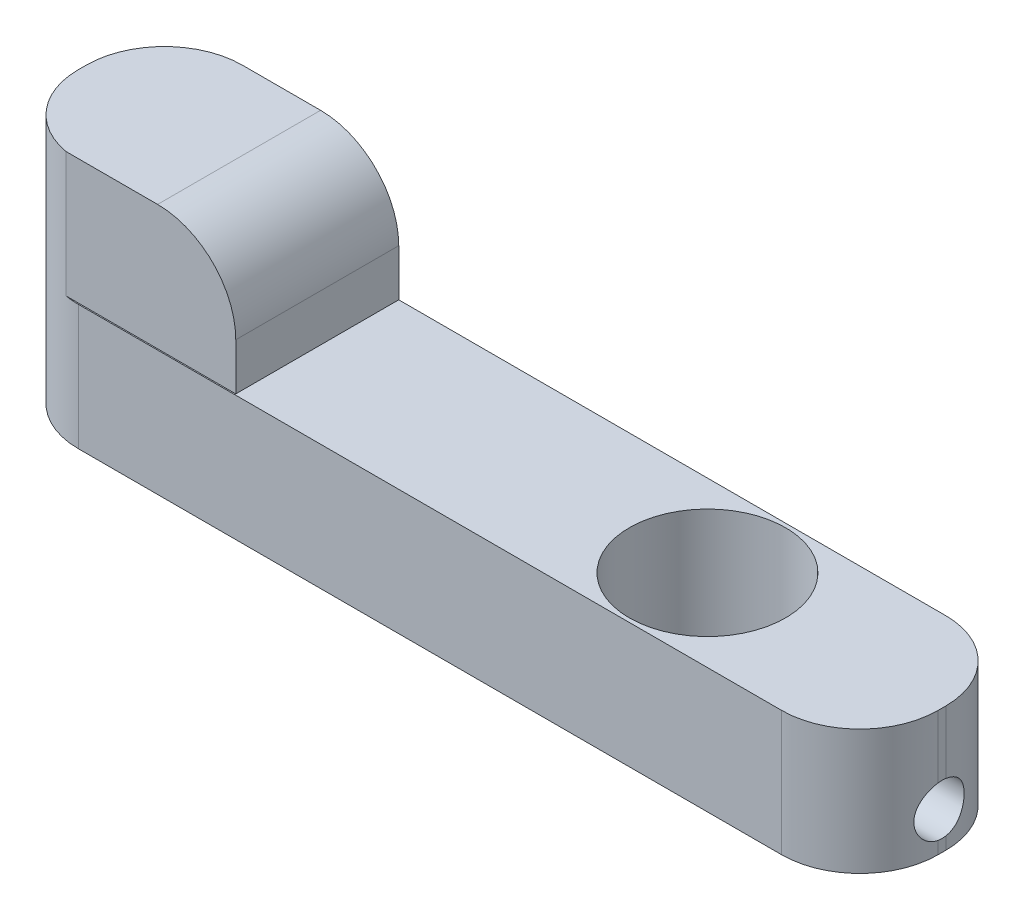
ISO-10303-21;
HEADER;
FILE_DESCRIPTION(('STEP AP214'),'2;1');
FILE_NAME('part.step','',(''),(''),'','','');
FILE_SCHEMA(('AUTOMOTIVE_DESIGN { 1 0 10303 214 1 1 1 1 }'));
ENDSEC;
DATA;
#1=APPLICATION_CONTEXT('core data for automotive mechanical design processes');
#2=APPLICATION_PROTOCOL_DEFINITION('international standard','automotive_design',2000,#1);
#3=PRODUCT_CONTEXT('',#1,'mechanical');
#4=PRODUCT('Part','Part','',(#3));
#5=PRODUCT_RELATED_PRODUCT_CATEGORY('part','',(#4));
#6=PRODUCT_DEFINITION_FORMATION('','',#4);
#7=PRODUCT_DEFINITION_CONTEXT('part definition',#1,'design');
#8=PRODUCT_DEFINITION('design','',#6,#7);
#9=PRODUCT_DEFINITION_SHAPE('','',#8);
#10=(LENGTH_UNIT() NAMED_UNIT(*) SI_UNIT(.MILLI.,.METRE.));
#11=(NAMED_UNIT(*) PLANE_ANGLE_UNIT() SI_UNIT($,.RADIAN.));
#12=(NAMED_UNIT(*) SI_UNIT($,.STERADIAN.) SOLID_ANGLE_UNIT());
#13=UNCERTAINTY_MEASURE_WITH_UNIT(LENGTH_MEASURE(1.E-05),#10,'distance_accuracy_value','');
#14=(GEOMETRIC_REPRESENTATION_CONTEXT(3) GLOBAL_UNCERTAINTY_ASSIGNED_CONTEXT((#13)) GLOBAL_UNIT_ASSIGNED_CONTEXT((#10,
#11,#12)) REPRESENTATION_CONTEXT('',''));
#15=CARTESIAN_POINT('',(0.,0.,0.));
#16=DIRECTION('',(0.,0.,1.));
#17=DIRECTION('',(1.,0.,0.));
#18=AXIS2_PLACEMENT_3D('',#15,#16,#17);
#19=CARTESIAN_POINT('',(275.,80.,-52.5000000000001));
#20=DIRECTION('',(-1.,0.,0.));
#21=DIRECTION('',(0.,0.,1.));
#22=AXIS2_PLACEMENT_3D('',#19,#20,#21);
#23=PLANE('',#22);
#24=DIRECTION('',(0.,1.,0.));
#25=VECTOR('',#24,1.);
#26=CARTESIAN_POINT('',(275.,80.,2.4999999999999));
#27=LINE('',#26,#25);
#28=CARTESIAN_POINT('',(275.,80.,2.4999999999999));
#29=VERTEX_POINT('',#28);
#30=CARTESIAN_POINT('',(275.,39.8047162816568,2.4999999999999));
#31=VERTEX_POINT('',#30);
#32=EDGE_CURVE('E155',#29,#31,#27,.F.);
#33=ORIENTED_EDGE('',*,*,#32,.T.);
#34=CARTESIAN_POINT('',(275.,23.9,-1.45386348462818E-13));
#35=DIRECTION('',(1.,0.,0.));
#36=DIRECTION('',(0.,0.,-1.));
#37=AXIS2_PLACEMENT_3D('',#34,#35,#36);
#38=CIRCLE('',#37,16.1);
#39=CARTESIAN_POINT('',(275.,39.8047162816569,-2.5000000000001));
#40=VERTEX_POINT('',#39);
#41=EDGE_CURVE('E141',#40,#31,#38,.T.);
#42=ORIENTED_EDGE('',*,*,#41,.F.);
#43=DIRECTION('',(0.,1.,0.));
#44=VECTOR('',#43,1.);
#45=CARTESIAN_POINT('',(275.,80.,-2.5000000000001));
#46=LINE('',#45,#44);
#47=CARTESIAN_POINT('',(275.,80.,-2.5000000000001));
#48=VERTEX_POINT('',#47);
#49=EDGE_CURVE('E152',#40,#48,#46,.T.);
#50=ORIENTED_EDGE('',*,*,#49,.T.);
#51=DIRECTION('',(0.,0.,-1.));
#52=VECTOR('',#51,1.);
#53=CARTESIAN_POINT('',(275.,80.,-52.5000000000001));
#54=LINE('',#53,#52);
#55=EDGE_CURVE('E250',#29,#48,#54,.T.);
#56=ORIENTED_EDGE('',*,*,#55,.F.);
#57=EDGE_LOOP('',(#33,#42,#50,#56));
#58=FACE_BOUND('',#57,.T.);
#59=ADVANCED_FACE('F33',(#58),#23,.F.);
#60=CARTESIAN_POINT('',(-175.,110.,0.));
#61=DIRECTION('',(0.,0.,1.));
#62=DIRECTION('',(1.,0.,0.));
#63=AXIS2_PLACEMENT_3D('',#60,#61,#62);
#64=CYLINDRICAL_SURFACE('',#63,50.);
#65=DIRECTION('',(0.,0.,-1.));
#66=VECTOR('',#65,1.);
#67=CARTESIAN_POINT('',(-175.,160.,0.));
#68=LINE('',#67,#66);
#69=CARTESIAN_POINT('',(-175.,160.,51.7681093220659));
#70=VERTEX_POINT('',#69);
#71=CARTESIAN_POINT('',(-175.,160.,-52.5000000000001));
#72=VERTEX_POINT('',#71);
#73=EDGE_CURVE('E205',#70,#72,#68,.T.);
#74=ORIENTED_EDGE('',*,*,#73,.F.);
#75=CARTESIAN_POINT('',(-175.,110.,51.7681093220659));
#76=DIRECTION('',(0.,0.,-1.));
#77=DIRECTION('',(-1.,0.,0.));
#78=AXIS2_PLACEMENT_3D('',#75,#76,#77);
#79=CIRCLE('',#78,50.);
#80=CARTESIAN_POINT('',(-125.,110.,51.7681093220659));
#81=VERTEX_POINT('',#80);
#82=EDGE_CURVE('E47',#81,#70,#79,.F.);
#83=ORIENTED_EDGE('',*,*,#82,.F.);
#84=DIRECTION('',(0.,0.,-1.));
#85=VECTOR('',#84,1.);
#86=CARTESIAN_POINT('',(-125.,110.,0.));
#87=LINE('',#86,#85);
#88=CARTESIAN_POINT('',(-125.,110.,-52.5000000000001));
#89=VERTEX_POINT('',#88);
#90=EDGE_CURVE('E208',#89,#81,#87,.F.);
#91=ORIENTED_EDGE('',*,*,#90,.F.);
#92=CARTESIAN_POINT('',(-175.,110.,-52.5));
#93=DIRECTION('',(0.,0.,1.));
#94=DIRECTION('',(1.,0.,0.));
#95=AXIS2_PLACEMENT_3D('',#92,#93,#94);
#96=CIRCLE('',#95,50.);
#97=EDGE_CURVE('E11',#72,#89,#96,.F.);
#98=ORIENTED_EDGE('',*,*,#97,.F.);
#99=EDGE_LOOP('',(#74,#83,#91,#98));
#100=FACE_BOUND('',#99,.T.);
#101=ADVANCED_FACE('F35',(#100),#64,.T.);
#102=CARTESIAN_POINT('',(-225.,80.,-2.50000000000002));
#103=DIRECTION('',(0.,1.,0.));
#104=DIRECTION('',(0.,0.,1.));
#105=AXIS2_PLACEMENT_3D('',#102,#103,#104);
#106=CYLINDRICAL_SURFACE('',#105,50.);
#107=DIRECTION('',(0.,1.,0.));
#108=VECTOR('',#107,1.);
#109=CARTESIAN_POINT('',(-225.,80.,-52.5));
#110=LINE('',#109,#108);
#111=CARTESIAN_POINT('',(-225.,0.,-52.5));
#112=VERTEX_POINT('',#111);
#113=CARTESIAN_POINT('',(-225.,160.,-52.5));
#114=VERTEX_POINT('',#113);
#115=EDGE_CURVE('E195',#112,#114,#110,.T.);
#116=ORIENTED_EDGE('',*,*,#115,.F.);
#117=CARTESIAN_POINT('',(-225.,0.,-2.50000000000002));
#118=DIRECTION('',(0.,1.,0.));
#119=DIRECTION('',(0.,0.,1.));
#120=AXIS2_PLACEMENT_3D('',#117,#118,#119);
#121=CIRCLE('',#120,50.);
#122=CARTESIAN_POINT('',(-275.,0.,-2.50000000000002));
#123=VERTEX_POINT('',#122);
#124=EDGE_CURVE('E201',#123,#112,#121,.F.);
#125=ORIENTED_EDGE('',*,*,#124,.F.);
#126=DIRECTION('',(0.,1.,0.));
#127=VECTOR('',#126,1.);
#128=CARTESIAN_POINT('',(-275.,80.,-2.50000000000002));
#129=LINE('',#128,#127);
#130=CARTESIAN_POINT('',(-275.,160.,-2.50000000000002));
#131=VERTEX_POINT('',#130);
#132=EDGE_CURVE('E198',#131,#123,#129,.F.);
#133=ORIENTED_EDGE('',*,*,#132,.F.);
#134=CARTESIAN_POINT('',(-225.,160.,-2.50000000000002));
#135=DIRECTION('',(0.,1.,0.));
#136=DIRECTION('',(0.,0.,1.));
#137=AXIS2_PLACEMENT_3D('',#134,#135,#136);
#138=CIRCLE('',#137,50.);
#139=EDGE_CURVE('E203',#114,#131,#138,.T.);
#140=ORIENTED_EDGE('',*,*,#139,.F.);
#141=EDGE_LOOP('',(#116,#125,#133,#140));
#142=FACE_BOUND('',#141,.T.);
#143=ADVANCED_FACE('F302',(#142),#106,.T.);
#144=CARTESIAN_POINT('',(-225.,80.,2.50000000000006));
#145=DIRECTION('',(0.,1.,0.));
#146=DIRECTION('',(0.,0.,1.));
#147=AXIS2_PLACEMENT_3D('',#144,#145,#146);
#148=CYLINDRICAL_SURFACE('',#147,50.);
#149=DIRECTION('',(0.,1.,0.));
#150=VECTOR('',#149,1.);
#151=CARTESIAN_POINT('',(-275.,80.,2.50000000000006));
#152=LINE('',#151,#150);
#153=CARTESIAN_POINT('',(-275.,0.,2.50000000000006));
#154=VERTEX_POINT('',#153);
#155=CARTESIAN_POINT('',(-275.,160.,2.50000000000006));
#156=VERTEX_POINT('',#155);
#157=EDGE_CURVE('E177',#154,#156,#152,.T.);
#158=ORIENTED_EDGE('',*,*,#157,.F.);
#159=CARTESIAN_POINT('',(-225.,0.,2.50000000000006));
#160=DIRECTION('',(0.,1.,0.));
#161=DIRECTION('',(0.,0.,1.));
#162=AXIS2_PLACEMENT_3D('',#159,#160,#161);
#163=CIRCLE('',#162,50.);
#164=CARTESIAN_POINT('',(-225.,0.,52.5000000000001));
#165=VERTEX_POINT('',#164);
#166=EDGE_CURVE('E192',#165,#154,#163,.F.);
#167=ORIENTED_EDGE('',*,*,#166,.F.);
#168=DIRECTION('',(0.,1.,0.));
#169=VECTOR('',#168,1.);
#170=CARTESIAN_POINT('',(-225.,80.,52.5000000000001));
#171=LINE('',#170,#169);
#172=CARTESIAN_POINT('',(-225.,80.,52.5000000000001));
#173=VERTEX_POINT('',#172);
#174=EDGE_CURVE('E189',#173,#165,#171,.F.);
#175=ORIENTED_EDGE('',*,*,#174,.F.);
#176=CARTESIAN_POINT('',(-225.,80.,2.50000000000006));
#177=DIRECTION('',(0.,1.,0.));
#178=DIRECTION('',(0.,0.,1.));
#179=AXIS2_PLACEMENT_3D('',#176,#177,#178);
#180=CIRCLE('',#179,50.);
#181=CARTESIAN_POINT('',(-233.523696605873,80.,51.7681093220659));
#182=VERTEX_POINT('',#181);
#183=EDGE_CURVE('E186',#182,#173,#180,.T.);
#184=ORIENTED_EDGE('',*,*,#183,.F.);
#185=DIRECTION('',(0.,1.,0.));
#186=VECTOR('',#185,1.);
#187=CARTESIAN_POINT('',(-233.523696605873,80.,51.7681093220659));
#188=LINE('',#187,#186);
#189=CARTESIAN_POINT('',(-233.523696605873,160.,51.7681093220659));
#190=VERTEX_POINT('',#189);
#191=EDGE_CURVE('E183',#190,#182,#188,.F.);
#192=ORIENTED_EDGE('',*,*,#191,.F.);
#193=CARTESIAN_POINT('',(-225.,160.,2.50000000000006));
#194=DIRECTION('',(0.,1.,0.));
#195=DIRECTION('',(0.,0.,1.));
#196=AXIS2_PLACEMENT_3D('',#193,#194,#195);
#197=CIRCLE('',#196,50.);
#198=EDGE_CURVE('E180',#156,#190,#197,.T.);
#199=ORIENTED_EDGE('',*,*,#198,.F.);
#200=EDGE_LOOP('',(#158,#167,#175,#184,#192,#199));
#201=FACE_BOUND('',#200,.T.);
#202=ADVANCED_FACE('F288',(#201),#148,.T.);
#203=CARTESIAN_POINT('',(225.,80.,-2.50000000000007));
#204=DIRECTION('',(0.,1.,0.));
#205=DIRECTION('',(0.,0.,1.));
#206=AXIS2_PLACEMENT_3D('',#203,#204,#205);
#207=CYLINDRICAL_SURFACE('',#206,50.);
#208=CARTESIAN_POINT('',(275.,7.99528371834317,-2.5000000000001));
#209=CARTESIAN_POINT('',(275.000001844819,8.02976171399735,-2.71934779887314));
#210=CARTESIAN_POINT('',(274.998556149294,8.06877448312856,-2.93795344920981));
#211=CARTESIAN_POINT('',(274.992846280137,8.15579492356494,-3.37332081567455));
#212=CARTESIAN_POINT('',(274.988582221754,8.20380222700094,-3.59008260683607));
#213=CARTESIAN_POINT('',(274.971682461882,8.36115991358615,-4.2368887934846));
#214=CARTESIAN_POINT('',(274.954939033661,8.4838783163002,-4.66365889488283));
#215=CARTESIAN_POINT('',(274.911443128211,8.76359781851189,-5.50409828920898));
#216=CARTESIAN_POINT('',(274.884714176627,8.92051798034003,-5.91779591528599));
#217=CARTESIAN_POINT('',(274.822386733283,9.26758266889617,-6.73034295329525));
#218=CARTESIAN_POINT('',(274.786787915439,9.45772841702293,-7.12919181872128));
#219=CARTESIAN_POINT('',(274.70809601695,9.86967725603621,-7.90913828552635));
#220=CARTESIAN_POINT('',(274.665006770858,10.0914641386044,-8.29024484372423));
#221=CARTESIAN_POINT('',(274.572839441017,10.5651621258531,-9.0324934575102));
#222=CARTESIAN_POINT('',(274.52376118594,10.8170740923152,-9.3936349415295));
#223=CARTESIAN_POINT('',(274.421239735523,11.3493833241852,-10.0938352548167));
#224=CARTESIAN_POINT('',(274.367794826082,11.629791786329,-10.4328853174665));
#225=CARTESIAN_POINT('',(274.258285881277,12.2171689020123,-11.0866850252353));
#226=CARTESIAN_POINT('',(274.202221798424,12.5241380372059,-11.4014342294841));
#227=CARTESIAN_POINT('',(274.087734881649,13.1712654731432,-12.0128125531435));
#228=CARTESIAN_POINT('',(274.029289113219,13.5120930904636,-12.3087293100927));
#229=CARTESIAN_POINT('',(273.913442392769,14.2174960036351,-12.8709967819143));
#230=CARTESIAN_POINT('',(273.856041460049,14.5820717376013,-13.1373469510848));
#231=CARTESIAN_POINT('',(273.744182469068,15.3326486791967,-13.6387015669149));
#232=CARTESIAN_POINT('',(273.689724628953,15.718651470743,-13.8737036919032));
#233=CARTESIAN_POINT('',(273.585579545618,16.5095450929574,-14.3106703075547));
#234=CARTESIAN_POINT('',(273.535892282162,16.9144358434913,-14.5126349383664));
#235=CARTESIAN_POINT('',(273.442629890278,17.7435140940857,-14.8833942413322));
#236=CARTESIAN_POINT('',(273.399103449738,18.1678236448418,-15.0519285039674));
#237=CARTESIAN_POINT('',(273.320143644957,19.0299110345415,-15.3525443589385));
#238=CARTESIAN_POINT('',(273.284710344854,19.467688980191,-15.484625662386));
#239=CARTESIAN_POINT('',(273.223220821086,20.3534066752344,-15.7111606793124));
#240=CARTESIAN_POINT('',(273.197162166982,20.801343758745,-15.8056241461418));
#241=CARTESIAN_POINT('',(273.155365779596,21.7041014233461,-15.9561089501699));
#242=CARTESIAN_POINT('',(273.139627707888,22.158921778225,-16.0121315478966));
#243=CARTESIAN_POINT('',(273.11939360545,23.0568945953814,-16.0840087357415));
#244=CARTESIAN_POINT('',(273.114544727577,23.4999385951623,-16.1011242819436));
#245=CARTESIAN_POINT('',(273.115212761412,24.3859155729242,-16.0987612622983));
#246=CARTESIAN_POINT('',(273.120729444747,24.8288485531361,-16.0792835026669));
#247=CARTESIAN_POINT('',(273.141934939295,25.7113349024142,-16.0039113916969));
#248=CARTESIAN_POINT('',(273.157623307253,26.1508884179041,-15.9480186272282));
#249=CARTESIAN_POINT('',(273.198626534623,27.023457245665,-15.8003105994967));
#250=CARTESIAN_POINT('',(273.223941403782,27.4564725513154,-15.7084952998615));
#251=CARTESIAN_POINT('',(273.28291986134,28.3070083285516,-15.4912324068131));
#252=CARTESIAN_POINT('',(273.316463705493,28.7246600517506,-15.3662652689201));
#253=CARTESIAN_POINT('',(273.390970188481,29.5478619676194,-15.0831400217217));
#254=CARTESIAN_POINT('',(273.431932734694,29.9534123113009,-14.9249823267951));
#255=CARTESIAN_POINT('',(273.519967720156,30.749877202156,-14.5766298280702));
#256=CARTESIAN_POINT('',(273.56704093864,31.1407898745235,-14.3864309374455));
#257=CARTESIAN_POINT('',(273.665811619384,31.9055178157378,-13.9753409009761));
#258=CARTESIAN_POINT('',(273.717509197637,32.2793326553616,-13.7544489851768));
#259=CARTESIAN_POINT('',(273.825512937974,33.0184575605803,-13.2764130658042));
#260=CARTESIAN_POINT('',(273.881910468957,33.3831833758504,-13.0183857773871));
#261=CARTESIAN_POINT('',(273.99607929851,34.0898051999671,-12.4730543643065));
#262=CARTESIAN_POINT('',(274.053850629361,34.4317006716028,-12.1857495511277));
#263=CARTESIAN_POINT('',(274.168923977104,35.0906488978261,-11.5835484857764));
#264=CARTESIAN_POINT('',(274.226225826488,35.4076931041893,-11.2686428177988));
#265=CARTESIAN_POINT('',(274.31038717614,35.8628647552785,-10.7772793800123));
#266=CARTESIAN_POINT('',(274.338143252311,36.0111939708235,-10.6103184038889));
#267=CARTESIAN_POINT('',(274.392842694169,36.3008829329303,-10.2702487787656));
#268=CARTESIAN_POINT('',(274.419785836428,36.4422407701235,-10.0971384676323));
#269=CARTESIAN_POINT('',(274.500203616911,36.8614798118392,-9.56130933671515));
#270=CARTESIAN_POINT('',(274.552023211507,37.1278864574034,-9.18924685502231));
#271=CARTESIAN_POINT('',(274.649410188521,37.6283597235702,-8.42327118834474));
#272=CARTESIAN_POINT('',(274.694977715954,37.862427094274,-8.02935851046684));
#273=CARTESIAN_POINT('',(274.778102727297,38.296211539051,-7.22277626577359));
#274=CARTESIAN_POINT('',(274.81566900522,38.4959662782075,-6.81012790270549));
#275=CARTESIAN_POINT('',(274.881310226893,38.8597099134082,-5.9688393820861));
#276=CARTESIAN_POINT('',(274.909389084652,39.0237135485341,-5.54020590038455));
#277=CARTESIAN_POINT('',(274.95422593395,39.3110522897596,-4.68076322342811));
#278=CARTESIAN_POINT('',(274.971248482691,39.4352986099088,-4.25027414258476));
#279=CARTESIAN_POINT('',(274.988413623782,39.5943862043898,-3.59809538384361));
#280=CARTESIAN_POINT('',(274.99274047205,39.642848892873,-3.37975242025734));
#281=CARTESIAN_POINT('',(274.998534693818,39.7306475585639,-2.94119069215596));
#282=CARTESIAN_POINT('',(275.000001928615,39.7699830929857,-2.72097183717277));
#283=CARTESIAN_POINT('',(275.,39.8047162816569,-2.5000000000001));
#284=B_SPLINE_CURVE_WITH_KNOTS('',3,(#208,#209,#210,#211,#212,#213,#214,#215,#216,#217,#218,
#219,#220,#221,#222,#223,#224,#225,#226,#227,#228,#229,#230,#231,#232,#233,#234,#235,#236,#237,
#238,#239,#240,#241,#242,#243,#244,#245,#246,#247,#248,#249,#250,#251,#252,#253,#254,#255,#256,
#257,#258,#259,#260,#261,#262,#263,#264,#265,#266,#267,#268,#269,#270,#271,#272,#273,#274,#275,
#276,#277,#278,#279,#280,#281,#282,#283),.UNSPECIFIED.,.F.,.F.,(4,2,2,2,2,2,2,2,2,2,2,2,2,2,2,2,
2,2,2,2,2,2,2,2,2,2,2,2,2,2,2,2,2,2,2,2,2,4),(0.,0.666013366391099,1.33199949931854,
2.66335162218316,3.99158669280152,5.31987060066507,6.64747651588633,7.97512041872339,
9.30328800623353,10.6314796839263,11.9952926572457,13.359130797881,14.723069889884,
16.0870031957627,17.4611763368486,18.8353603678947,20.2091878755597,21.5829703314152,
22.9115527817885,24.2401059614596,25.5686012501589,26.897097883992,28.2073037103668,
29.5174931800033,30.8278498898641,32.1382394768197,33.4876295086417,34.8370512811902,
36.1869352031062,36.8619205737941,37.5370897989129,38.9168545059548,40.2965872043314,
41.6747955505997,43.0524346247918,44.3957598221891,45.0666709789485,45.737614676827),.UNSPECIFIED.);
#285=CARTESIAN_POINT('',(275.,7.99528371834317,-2.5000000000001));
#286=VERTEX_POINT('',#285);
#287=EDGE_CURVE('E137',#286,#40,#284,.T.);
#288=ORIENTED_EDGE('',*,*,#287,.F.);
#289=CARTESIAN_POINT('',(275.,0.,-2.5000000000001));
#290=VERTEX_POINT('',#289);
#291=EDGE_CURVE('E161',#290,#286,#46,.T.);
#292=ORIENTED_EDGE('',*,*,#291,.F.);
#293=CARTESIAN_POINT('',(225.,0.,-2.50000000000007));
#294=DIRECTION('',(0.,1.,0.));
#295=DIRECTION('',(0.,0.,1.));
#296=AXIS2_PLACEMENT_3D('',#293,#294,#295);
#297=CIRCLE('',#296,50.);
#298=CARTESIAN_POINT('',(225.,0.,-52.5000000000001));
#299=VERTEX_POINT('',#298);
#300=EDGE_CURVE('E171',#299,#290,#297,.F.);
#301=ORIENTED_EDGE('',*,*,#300,.F.);
#302=DIRECTION('',(0.,1.,0.));
#303=VECTOR('',#302,1.);
#304=CARTESIAN_POINT('',(225.,80.,-52.5000000000001));
#305=LINE('',#304,#303);
#306=CARTESIAN_POINT('',(225.,80.,-52.5000000000001));
#307=VERTEX_POINT('',#306);
#308=EDGE_CURVE('E164',#307,#299,#305,.F.);
#309=ORIENTED_EDGE('',*,*,#308,.F.);
#310=CARTESIAN_POINT('',(225.,80.,-2.50000000000007));
#311=DIRECTION('',(0.,1.,0.));
#312=DIRECTION('',(0.,0.,1.));
#313=AXIS2_PLACEMENT_3D('',#310,#311,#312);
#314=CIRCLE('',#313,50.);
#315=EDGE_CURVE('E159',#48,#307,#314,.T.);
#316=ORIENTED_EDGE('',*,*,#315,.F.);
#317=ORIENTED_EDGE('',*,*,#49,.F.);
#318=EDGE_LOOP('',(#288,#292,#301,#309,#316,#317));
#319=FACE_BOUND('',#318,.T.);
#320=ADVANCED_FACE('F157',(#319),#207,.T.);
#321=CARTESIAN_POINT('',(225.,80.,2.49999999999993));
#322=DIRECTION('',(0.,1.,0.));
#323=DIRECTION('',(0.,0.,1.));
#324=AXIS2_PLACEMENT_3D('',#321,#322,#323);
#325=CYLINDRICAL_SURFACE('',#324,50.);
#326=CARTESIAN_POINT('',(275.,39.8047162816568,2.4999999999999));
#327=CARTESIAN_POINT('',(275.000001844819,39.7702382860027,2.71934779887293));
#328=CARTESIAN_POINT('',(274.998556149294,39.7312255168715,2.9379534492096));
#329=CARTESIAN_POINT('',(274.992846280137,39.6442050764351,3.37332081567434));
#330=CARTESIAN_POINT('',(274.988582221754,39.5961977729991,3.59008260683586));
#331=CARTESIAN_POINT('',(274.971682461882,39.4388400864138,4.2368887934844));
#332=CARTESIAN_POINT('',(274.954939033661,39.3161216836998,4.66365889488262));
#333=CARTESIAN_POINT('',(274.911443128211,39.0364021814881,5.50409828920878));
#334=CARTESIAN_POINT('',(274.884714176627,38.87948201966,5.91779591528578));
#335=CARTESIAN_POINT('',(274.822386733283,38.5324173311038,6.73034295329505));
#336=CARTESIAN_POINT('',(274.786787915439,38.3422715829771,7.12919181872108));
#337=CARTESIAN_POINT('',(274.70809601695,37.9303227439638,7.90913828552613));
#338=CARTESIAN_POINT('',(274.665006770858,37.7085358613956,8.290244843724));
#339=CARTESIAN_POINT('',(274.572839441017,37.2348378741469,9.03249345750997));
#340=CARTESIAN_POINT('',(274.52376118594,36.9829259076848,9.39363494152927));
#341=CARTESIAN_POINT('',(274.421239735523,36.4506166758148,10.0938352548165));
#342=CARTESIAN_POINT('',(274.367794826082,36.1702082136709,10.4328853174662));
#343=CARTESIAN_POINT('',(274.258285881277,35.5828310979876,11.086685025235));
#344=CARTESIAN_POINT('',(274.202221798424,35.275861962794,11.4014342294838));
#345=CARTESIAN_POINT('',(274.087734881649,34.6287345268567,12.0128125531433));
#346=CARTESIAN_POINT('',(274.029289113219,34.2879069095363,12.3087293100924));
#347=CARTESIAN_POINT('',(273.913442392769,33.5825039963648,12.870996781914));
#348=CARTESIAN_POINT('',(273.856041460049,33.2179282623986,13.1373469510846));
#349=CARTESIAN_POINT('',(273.744182469068,32.4673513208032,13.6387015669147));
#350=CARTESIAN_POINT('',(273.689724628953,32.0813485292569,13.8737036919029));
#351=CARTESIAN_POINT('',(273.585579545618,31.2904549070425,14.3106703075544));
#352=CARTESIAN_POINT('',(273.535892282162,30.8855641565086,14.5126349383662));
#353=CARTESIAN_POINT('',(273.442629890278,30.0564859059143,14.8833942413319));
#354=CARTESIAN_POINT('',(273.399103449738,29.6321763551582,15.0519285039672));
#355=CARTESIAN_POINT('',(273.320143644957,28.7700889654585,15.3525443589383));
#356=CARTESIAN_POINT('',(273.284710344854,28.3323110198089,15.4846256623857));
#357=CARTESIAN_POINT('',(273.223220821086,27.4465933247656,15.7111606793122));
#358=CARTESIAN_POINT('',(273.197162166982,26.998656241255,15.8056241461415));
#359=CARTESIAN_POINT('',(273.155365779596,26.0958985766538,15.9561089501696));
#360=CARTESIAN_POINT('',(273.139627707888,25.6410782217749,16.0121315478963));
#361=CARTESIAN_POINT('',(273.11939360545,24.7431054046185,16.0840087357412));
#362=CARTESIAN_POINT('',(273.114544727577,24.3000614048377,16.1011242819433));
#363=CARTESIAN_POINT('',(273.115212761412,23.4140844270758,16.098761262298));
#364=CARTESIAN_POINT('',(273.120729444747,22.9711514468638,16.0792835026666));
#365=CARTESIAN_POINT('',(273.141934939295,22.0886650975857,16.0039113916966));
#366=CARTESIAN_POINT('',(273.157623307253,21.6491115820958,15.9480186272279));
#367=CARTESIAN_POINT('',(273.198626534623,20.776542754335,15.8003105994964));
#368=CARTESIAN_POINT('',(273.223941403782,20.3435274486845,15.7084952998612));
#369=CARTESIAN_POINT('',(273.28291986134,19.4929916714483,15.4912324068127));
#370=CARTESIAN_POINT('',(273.316463705493,19.0753399482493,15.3662652689197));
#371=CARTESIAN_POINT('',(273.390970188481,18.2521380323805,15.0831400217213));
#372=CARTESIAN_POINT('',(273.431932734694,17.8465876886991,14.9249823267948));
#373=CARTESIAN_POINT('',(273.519967720156,17.0501227978439,14.5766298280699));
#374=CARTESIAN_POINT('',(273.56704093864,16.6592101254765,14.3864309374452));
#375=CARTESIAN_POINT('',(273.665811619384,15.8944821842622,13.9753409009758));
#376=CARTESIAN_POINT('',(273.717509197637,15.5206673446384,13.7544489851765));
#377=CARTESIAN_POINT('',(273.825512937974,14.7815424394197,13.2764130658038));
#378=CARTESIAN_POINT('',(273.881910468957,14.4168166241496,13.0183857773868));
#379=CARTESIAN_POINT('',(273.99607929851,13.7101948000329,12.4730543643061));
#380=CARTESIAN_POINT('',(274.053850629361,13.3682993283972,12.1857495511273));
#381=CARTESIAN_POINT('',(274.168923977104,12.7093511021738,11.5835484857761));
#382=CARTESIAN_POINT('',(274.226225826488,12.3923068958107,11.2686428177985));
#383=CARTESIAN_POINT('',(274.31038717614,11.9371352447215,10.777279380012));
#384=CARTESIAN_POINT('',(274.338143252312,11.7888060291765,10.6103184038885));
#385=CARTESIAN_POINT('',(274.392842694169,11.4991170670697,10.2702487787652));
#386=CARTESIAN_POINT('',(274.419785836428,11.3577592298765,10.097138467632));
#387=CARTESIAN_POINT('',(274.500203616911,10.9385201881608,9.56130933671479));
#388=CARTESIAN_POINT('',(274.552023211507,10.6721135425966,9.18924685502195));
#389=CARTESIAN_POINT('',(274.649410188521,10.1716402764298,8.42327118834437));
#390=CARTESIAN_POINT('',(274.694977715954,9.93757290572596,8.02935851046647));
#391=CARTESIAN_POINT('',(274.778102727297,9.50378846094902,7.22277626577322));
#392=CARTESIAN_POINT('',(274.81566900522,9.30403372179247,6.81012790270511));
#393=CARTESIAN_POINT('',(274.881310226893,8.94029008659183,5.96883938208572));
#394=CARTESIAN_POINT('',(274.909389084652,8.77628645146591,5.54020590038417));
#395=CARTESIAN_POINT('',(274.95422593395,8.48894771024045,4.68076322342777));
#396=CARTESIAN_POINT('',(274.971248482691,8.36470139009119,4.25027414258445));
#397=CARTESIAN_POINT('',(274.988413623782,8.20561379561024,3.59809538384334));
#398=CARTESIAN_POINT('',(274.99274047205,8.15715110712699,3.37975242025708));
#399=CARTESIAN_POINT('',(274.998534693818,8.06935244143619,2.94119069215573));
#400=CARTESIAN_POINT('',(275.000001928615,8.03001690701437,2.72097183717256));
#401=CARTESIAN_POINT('',(275.,7.99528371834319,2.4999999999999));
#402=B_SPLINE_CURVE_WITH_KNOTS('',3,(#326,#327,#328,#329,#330,#331,#332,#333,#334,#335,#336,
#337,#338,#339,#340,#341,#342,#343,#344,#345,#346,#347,#348,#349,#350,#351,#352,#353,#354,#355,
#356,#357,#358,#359,#360,#361,#362,#363,#364,#365,#366,#367,#368,#369,#370,#371,#372,#373,#374,
#375,#376,#377,#378,#379,#380,#381,#382,#383,#384,#385,#386,#387,#388,#389,#390,#391,#392,#393,
#394,#395,#396,#397,#398,#399,#400,#401),.UNSPECIFIED.,.F.,.F.,(4,2,2,2,2,2,2,2,2,2,2,2,2,2,2,2,
2,2,2,2,2,2,2,2,2,2,2,2,2,2,2,2,2,2,2,2,2,4),(0.,0.666013366391097,1.33199949931854,
2.66335162218316,3.99158669280154,5.31987060066507,6.64747651588632,7.97512041872339,
9.30328800623353,10.6314796839263,11.9952926572457,13.359130797881,14.723069889884,
16.0870031957627,17.4611763368486,18.8353603678947,20.2091878755597,21.5829703314152,
22.9115527817885,24.2401059614596,25.5686012501589,26.897097883992,28.2073037103668,
29.5174931800033,30.8278498898641,32.1382394768197,33.4876295086417,34.8370512811902,
36.1869352031062,36.8619205737941,37.5370897989129,38.9168545059548,40.2965872043314,
41.6747955505997,43.0524346247918,44.395759822189,45.0666709789484,45.7376146768268),.UNSPECIFIED.);
#403=CARTESIAN_POINT('',(275.,7.99528371834319,2.4999999999999));
#404=VERTEX_POINT('',#403);
#405=EDGE_CURVE('E54',#31,#404,#402,.T.);
#406=ORIENTED_EDGE('',*,*,#405,.F.);
#407=ORIENTED_EDGE('',*,*,#32,.F.);
#408=CARTESIAN_POINT('',(225.,80.,2.49999999999993));
#409=DIRECTION('',(0.,1.,0.));
#410=DIRECTION('',(0.,0.,1.));
#411=AXIS2_PLACEMENT_3D('',#408,#409,#410);
#412=CIRCLE('',#411,50.);
#413=CARTESIAN_POINT('',(225.,80.,52.4999999999999));
#414=VERTEX_POINT('',#413);
#415=EDGE_CURVE('E162',#414,#29,#412,.T.);
#416=ORIENTED_EDGE('',*,*,#415,.F.);
#417=DIRECTION('',(0.,1.,0.));
#418=VECTOR('',#417,1.);
#419=CARTESIAN_POINT('',(225.,80.,52.4999999999999));
#420=LINE('',#419,#418);
#421=CARTESIAN_POINT('',(225.,0.,52.4999999999999));
#422=VERTEX_POINT('',#421);
#423=EDGE_CURVE('E258',#422,#414,#420,.T.);
#424=ORIENTED_EDGE('',*,*,#423,.F.);
#425=CARTESIAN_POINT('',(225.,0.,2.49999999999993));
#426=DIRECTION('',(0.,1.,0.));
#427=DIRECTION('',(0.,0.,1.));
#428=AXIS2_PLACEMENT_3D('',#425,#426,#427);
#429=CIRCLE('',#428,50.);
#430=CARTESIAN_POINT('',(275.,0.,2.4999999999999));
#431=VERTEX_POINT('',#430);
#432=EDGE_CURVE('E165',#431,#422,#429,.F.);
#433=ORIENTED_EDGE('',*,*,#432,.F.);
#434=EDGE_CURVE('E269',#404,#431,#27,.F.);
#435=ORIENTED_EDGE('',*,*,#434,.F.);
#436=EDGE_LOOP('',(#406,#407,#416,#424,#433,#435));
#437=FACE_BOUND('',#436,.T.);
#438=ADVANCED_FACE('F282',(#437),#325,.T.);
#439=CARTESIAN_POINT('',(0.,80.,0.));
#440=DIRECTION('',(0.,1.,0.));
#441=DIRECTION('',(0.,0.,1.));
#442=AXIS2_PLACEMENT_3D('',#439,#440,#441);
#443=PLANE('',#442);
#444=DIRECTION('',(1.,0.,0.));
#445=VECTOR('',#444,1.);
#446=CARTESIAN_POINT('',(-275.,80.,51.7681093220659));
#447=LINE('',#446,#445);
#448=CARTESIAN_POINT('',(-125.,80.,51.7681093220659));
#449=VERTEX_POINT('',#448);
#450=EDGE_CURVE('E231',#182,#449,#447,.T.);
#451=ORIENTED_EDGE('',*,*,#450,.F.);
#452=ORIENTED_EDGE('',*,*,#183,.T.);
#453=DIRECTION('',(1.,0.,0.));
#454=VECTOR('',#453,1.);
#455=CARTESIAN_POINT('',(-275.,80.,52.5000000000001));
#456=LINE('',#455,#454);
#457=EDGE_CURVE('E256',#173,#414,#456,.T.);
#458=ORIENTED_EDGE('',*,*,#457,.T.);
#459=ORIENTED_EDGE('',*,*,#415,.T.);
#460=ORIENTED_EDGE('',*,*,#55,.T.);
#461=ORIENTED_EDGE('',*,*,#315,.T.);
#462=DIRECTION('',(-1.,0.,0.));
#463=VECTOR('',#462,1.);
#464=CARTESIAN_POINT('',(-275.,80.,-52.5));
#465=LINE('',#464,#463);
#466=CARTESIAN_POINT('',(-125.,80.,-52.5));
#467=VERTEX_POINT('',#466);
#468=EDGE_CURVE('E252',#307,#467,#465,.T.);
#469=ORIENTED_EDGE('',*,*,#468,.T.);
#470=DIRECTION('',(0.,0.,-1.));
#471=VECTOR('',#470,1.);
#472=CARTESIAN_POINT('',(-125.,80.,-52.5000000000001));
#473=LINE('',#472,#471);
#474=EDGE_CURVE('E227',#449,#467,#473,.T.);
#475=ORIENTED_EDGE('',*,*,#474,.F.);
#476=EDGE_LOOP('',(#451,#452,#458,#459,#460,#461,#469,#475));
#477=FACE_BOUND('',#476,.T.);
#478=CARTESIAN_POINT('',(125.,80.,0.));
#479=DIRECTION('',(0.,1.,0.));
#480=DIRECTION('',(0.,0.,1.));
#481=AXIS2_PLACEMENT_3D('',#478,#479,#480);
#482=CIRCLE('',#481,50.0000000000001);
#483=CARTESIAN_POINT('',(125.,80.,50.0000000000001));
#484=VERTEX_POINT('',#483);
#485=EDGE_CURVE('E238',#484,#484,#482,.T.);
#486=ORIENTED_EDGE('',*,*,#485,.F.);
#487=EDGE_LOOP('',(#486));
#488=FACE_BOUND('',#487,.T.);
#489=ADVANCED_FACE('F291',(#477,#488),#443,.T.);
#490=CARTESIAN_POINT('',(0.,0.,0.));
#491=DIRECTION('',(0.,1.,0.));
#492=DIRECTION('',(0.,0.,1.));
#493=AXIS2_PLACEMENT_3D('',#490,#491,#492);
#494=PLANE('',#493);
#495=DIRECTION('',(0.,0.,1.));
#496=VECTOR('',#495,1.);
#497=CARTESIAN_POINT('',(-275.,0.,-52.5));
#498=LINE('',#497,#496);
#499=EDGE_CURVE('E264',#123,#154,#498,.T.);
#500=ORIENTED_EDGE('',*,*,#499,.F.);
#501=ORIENTED_EDGE('',*,*,#124,.T.);
#502=DIRECTION('',(-1.,0.,0.));
#503=VECTOR('',#502,1.);
#504=CARTESIAN_POINT('',(-275.,0.,-52.5));
#505=LINE('',#504,#503);
#506=EDGE_CURVE('E261',#299,#112,#505,.T.);
#507=ORIENTED_EDGE('',*,*,#506,.F.);
#508=ORIENTED_EDGE('',*,*,#300,.T.);
#509=DIRECTION('',(0.,0.,-1.));
#510=VECTOR('',#509,1.);
#511=CARTESIAN_POINT('',(275.,0.,-52.5000000000001));
#512=LINE('',#511,#510);
#513=EDGE_CURVE('E249',#431,#290,#512,.T.);
#514=ORIENTED_EDGE('',*,*,#513,.F.);
#515=ORIENTED_EDGE('',*,*,#432,.T.);
#516=DIRECTION('',(1.,0.,0.));
#517=VECTOR('',#516,1.);
#518=CARTESIAN_POINT('',(-275.,0.,52.5000000000001));
#519=LINE('',#518,#517);
#520=EDGE_CURVE('E253',#165,#422,#519,.T.);
#521=ORIENTED_EDGE('',*,*,#520,.F.);
#522=ORIENTED_EDGE('',*,*,#166,.T.);
#523=EDGE_LOOP('',(#500,#501,#507,#508,#514,#515,#521,#522));
#524=FACE_BOUND('',#523,.T.);
#525=CARTESIAN_POINT('',(-220.,0.,0.));
#526=DIRECTION('',(0.,1.,0.));
#527=DIRECTION('',(0.,0.,1.));
#528=AXIS2_PLACEMENT_3D('',#525,#526,#527);
#529=CIRCLE('',#528,50.);
#530=CARTESIAN_POINT('',(-220.,0.,50.));
#531=VERTEX_POINT('',#530);
#532=EDGE_CURVE('E241',#531,#531,#529,.T.);
#533=ORIENTED_EDGE('',*,*,#532,.T.);
#534=EDGE_LOOP('',(#533));
#535=FACE_BOUND('',#534,.T.);
#536=CARTESIAN_POINT('',(125.,0.,0.));
#537=DIRECTION('',(0.,1.,0.));
#538=DIRECTION('',(0.,0.,1.));
#539=AXIS2_PLACEMENT_3D('',#536,#537,#538);
#540=CIRCLE('',#539,50.0000000000001);
#541=CARTESIAN_POINT('',(125.,0.,50.0000000000001));
#542=VERTEX_POINT('',#541);
#543=EDGE_CURVE('E242',#542,#542,#540,.T.);
#544=ORIENTED_EDGE('',*,*,#543,.T.);
#545=EDGE_LOOP('',(#544));
#546=FACE_BOUND('',#545,.T.);
#547=ADVANCED_FACE('F277',(#524,#535,#546),#494,.F.);
#548=ORIENTED_EDGE('',*,*,#291,.T.);
#549=EDGE_CURVE('E142',#404,#286,#38,.T.);
#550=ORIENTED_EDGE('',*,*,#549,.F.);
#551=ORIENTED_EDGE('',*,*,#434,.T.);
#552=ORIENTED_EDGE('',*,*,#513,.T.);
#553=EDGE_LOOP('',(#548,#550,#551,#552));
#554=FACE_BOUND('',#553,.T.);
#555=ADVANCED_FACE('F307',(#554),#23,.F.);
#556=CARTESIAN_POINT('',(-275.,80.,-52.5));
#557=DIRECTION('',(0.,0.,1.));
#558=DIRECTION('',(1.,0.,0.));
#559=AXIS2_PLACEMENT_3D('',#556,#557,#558);
#560=PLANE('',#559);
#561=DIRECTION('',(-1.,0.,0.));
#562=VECTOR('',#561,1.);
#563=CARTESIAN_POINT('',(-275.,160.,-52.5));
#564=LINE('',#563,#562);
#565=EDGE_CURVE('E222',#72,#114,#564,.T.);
#566=ORIENTED_EDGE('',*,*,#565,.F.);
#567=ORIENTED_EDGE('',*,*,#97,.T.);
#568=DIRECTION('',(0.,-1.,0.));
#569=VECTOR('',#568,1.);
#570=CARTESIAN_POINT('',(-125.,160.,-52.5000000000001));
#571=LINE('',#570,#569);
#572=EDGE_CURVE('E225',#89,#467,#571,.T.);
#573=ORIENTED_EDGE('',*,*,#572,.T.);
#574=ORIENTED_EDGE('',*,*,#468,.F.);
#575=ORIENTED_EDGE('',*,*,#308,.T.);
#576=ORIENTED_EDGE('',*,*,#506,.T.);
#577=ORIENTED_EDGE('',*,*,#115,.T.);
#578=EDGE_LOOP('',(#566,#567,#573,#574,#575,#576,#577));
#579=FACE_BOUND('',#578,.T.);
#580=ADVANCED_FACE('F304',(#579),#560,.F.);
#581=CARTESIAN_POINT('',(-275.,80.,-52.5));
#582=DIRECTION('',(1.,0.,0.));
#583=DIRECTION('',(0.,0.,-1.));
#584=AXIS2_PLACEMENT_3D('',#581,#582,#583);
#585=PLANE('',#584);
#586=DIRECTION('',(0.,0.,1.));
#587=VECTOR('',#586,1.);
#588=CARTESIAN_POINT('',(-275.,160.,-52.5));
#589=LINE('',#588,#587);
#590=EDGE_CURVE('E223',#131,#156,#589,.T.);
#591=ORIENTED_EDGE('',*,*,#590,.F.);
#592=ORIENTED_EDGE('',*,*,#132,.T.);
#593=ORIENTED_EDGE('',*,*,#499,.T.);
#594=ORIENTED_EDGE('',*,*,#157,.T.);
#595=EDGE_LOOP('',(#591,#592,#593,#594));
#596=FACE_BOUND('',#595,.T.);
#597=ADVANCED_FACE('F296',(#596),#585,.F.);
#598=CARTESIAN_POINT('',(-275.,80.,52.5000000000001));
#599=DIRECTION('',(0.,0.,-1.));
#600=DIRECTION('',(-1.,0.,0.));
#601=AXIS2_PLACEMENT_3D('',#598,#599,#600);
#602=PLANE('',#601);
#603=ORIENTED_EDGE('',*,*,#457,.F.);
#604=ORIENTED_EDGE('',*,*,#174,.T.);
#605=ORIENTED_EDGE('',*,*,#520,.T.);
#606=ORIENTED_EDGE('',*,*,#423,.T.);
#607=EDGE_LOOP('',(#603,#604,#605,#606));
#608=FACE_BOUND('',#607,.T.);
#609=ADVANCED_FACE('F285',(#608),#602,.F.);
#610=CARTESIAN_POINT('',(-220.,80.,0.));
#611=DIRECTION('',(0.,-1.,0.));
#612=DIRECTION('',(0.,0.,-1.));
#613=AXIS2_PLACEMENT_3D('',#610,#611,#612);
#614=CYLINDRICAL_SURFACE('',#613,50.);
#615=CARTESIAN_POINT('',(-220.,80.,0.));
#616=DIRECTION('',(0.,1.,0.));
#617=DIRECTION('',(0.,0.,1.));
#618=AXIS2_PLACEMENT_3D('',#615,#616,#617);
#619=CIRCLE('',#618,50.);
#620=CARTESIAN_POINT('',(-220.,80.,50.));
#621=VERTEX_POINT('',#620);
#622=EDGE_CURVE('E237',#621,#621,#619,.T.);
#623=ORIENTED_EDGE('',*,*,#622,.T.);
#624=EDGE_LOOP('',(#623));
#625=FACE_BOUND('',#624,.T.);
#626=ORIENTED_EDGE('',*,*,#532,.F.);
#627=EDGE_LOOP('',(#626));
#628=FACE_BOUND('',#627,.T.);
#629=ADVANCED_FACE('F350',(#625,#628),#614,.F.);
#630=CARTESIAN_POINT('',(125.,80.,0.));
#631=DIRECTION('',(0.,-1.,0.));
#632=DIRECTION('',(0.,0.,-1.));
#633=AXIS2_PLACEMENT_3D('',#630,#631,#632);
#634=CYLINDRICAL_SURFACE('',#633,50.0000000000001);
#635=CARTESIAN_POINT('',(172.336983427337,23.9,-16.1000000000001));
#636=CARTESIAN_POINT('',(172.336983603725,23.4605922779518,-16.0999997836867));
#637=CARTESIAN_POINT('',(172.343118261905,23.0211808821081,-16.0819962345794));
#638=CARTESIAN_POINT('',(172.367460111644,22.1456355243728,-16.0101577000357));
#639=CARTESIAN_POINT('',(172.385667445427,21.7095016011532,-15.9563222924765));
#640=CARTESIAN_POINT('',(172.433579623214,20.8436312690368,-15.8133233670299));
#641=CARTESIAN_POINT('',(172.463286582766,20.4138960524041,-15.7241533486773));
#642=CARTESIAN_POINT('',(172.533271825781,19.5639489082016,-15.5113055168458));
#643=CARTESIAN_POINT('',(172.573550145049,19.1437370128919,-15.3876275864905));
#644=CARTESIAN_POINT('',(172.663372175637,18.3164673606126,-15.1071035494772));
#645=CARTESIAN_POINT('',(172.712898155215,17.9093861497198,-14.950320844878));
#646=CARTESIAN_POINT('',(172.819820045832,17.1101503658521,-14.6047083908242));
#647=CARTESIAN_POINT('',(172.877215943243,16.7179957670298,-14.4158786968666));
#648=CARTESIAN_POINT('',(172.998269973511,15.9509500850378,-14.0075482671505));
#649=CARTESIAN_POINT('',(173.061928914785,15.5760612396814,-13.788043570398));
#650=CARTESIAN_POINT('',(173.193775013279,14.8457760647842,-13.3198789123281));
#651=CARTESIAN_POINT('',(173.261962435807,14.4903808795459,-13.0712172421425));
#652=CARTESIAN_POINT('',(173.403369688726,13.7897174632947,-12.5376414682043));
#653=CARTESIAN_POINT('',(173.476681384266,13.4451737616962,-12.2517998729236));
#654=CARTESIAN_POINT('',(173.624207235266,12.7811716869086,-11.6525392582349));
#655=CARTESIAN_POINT('',(173.698421408404,12.4617138060637,-11.3391196978267));
#656=CARTESIAN_POINT('',(173.845764078821,11.8498183349628,-10.6865897718284));
#657=CARTESIAN_POINT('',(173.918892398472,11.5573851254974,-10.3474752571573));
#658=CARTESIAN_POINT('',(174.062094484249,11.0015017750237,-9.64567880865987));
#659=CARTESIAN_POINT('',(174.132168340875,10.7380507749581,-9.28299757387814));
#660=CARTESIAN_POINT('',(174.26903247505,10.2359104458713,-8.52721749451682));
#661=CARTESIAN_POINT('',(174.3357019479,9.9979763450408,-8.13359435954517));
#662=CARTESIAN_POINT('',(174.461991757049,9.5562402277458,-7.32653884113732));
#663=CARTESIAN_POINT('',(174.521611945952,9.35243892493213,-6.91310604375173));
#664=CARTESIAN_POINT('',(174.632083467326,8.98070997270628,-6.06937007363296));
#665=CARTESIAN_POINT('',(174.682936497114,8.81277537800662,-5.63907018620515));
#666=CARTESIAN_POINT('',(174.774404019726,8.51424343077784,-4.76465113463418));
#667=CARTESIAN_POINT('',(174.815018919387,8.38364459459156,-4.32053252040073));
#668=CARTESIAN_POINT('',(174.883668991301,8.16466131970411,-3.43651875204389));
#669=CARTESIAN_POINT('',(174.912071442051,8.07503832208161,-2.99695876013711));
#670=CARTESIAN_POINT('',(174.957371262326,7.93273643208028,-2.11131041038942));
#671=CARTESIAN_POINT('',(174.974268859521,7.88005680862402,-1.66522218191501));
#672=CARTESIAN_POINT('',(174.996075104646,7.81216107718728,-0.770004238111553));
#673=CARTESIAN_POINT('',(175.000986241075,7.7969371930506,-0.320875173506828));
#674=CARTESIAN_POINT('',(174.99868563634,7.80408183564291,0.577047790946115));
#675=CARTESIAN_POINT('',(174.991474155097,7.82644955637263,1.02584169777402));
#676=CARTESIAN_POINT('',(174.965620728099,7.90704422172699,1.90322781756726));
#677=CARTESIAN_POINT('',(174.947407841369,7.96392548288124,2.33195711861447));
#678=CARTESIAN_POINT('',(174.900409337219,8.11184725578469,3.18287784460606));
#679=CARTESIAN_POINT('',(174.87162402445,8.20288678324207,3.60506945757302));
#680=CARTESIAN_POINT('',(174.804230550792,8.41833862203239,4.44005420702189));
#681=CARTESIAN_POINT('',(174.765622024659,8.54275217428037,4.85284699341677));
#682=CARTESIAN_POINT('',(174.679575049698,8.82392363731275,5.66631546581895));
#683=CARTESIAN_POINT('',(174.632136414509,8.98068223074879,6.0669908958812));
#684=CARTESIAN_POINT('',(174.528980916063,9.32750205172619,6.85867485886561));
#685=CARTESIAN_POINT('',(174.473167034605,9.51795901621123,7.24949729648072));
#686=CARTESIAN_POINT('',(174.355138976536,9.9293679346552,8.01372421698223));
#687=CARTESIAN_POINT('',(174.292924775868,10.1503200032459,8.38712863438686));
#688=CARTESIAN_POINT('',(174.16364865425,10.6212347669459,9.11438982751561));
#689=CARTESIAN_POINT('',(174.096585742809,10.8712033958901,9.46824258304528));
#690=CARTESIAN_POINT('',(173.959295395029,11.3985042887221,10.1542999202268));
#691=CARTESIAN_POINT('',(173.889067783626,11.6758380673896,10.4865033017999));
#692=CARTESIAN_POINT('',(173.744068520216,12.2689851978372,11.1415087652276));
#693=CARTESIAN_POINT('',(173.669233106519,12.585956570929,11.4632489790909));
#694=CARTESIAN_POINT('',(173.520070549427,13.245867694032,12.0790375469684));
#695=CARTESIAN_POINT('',(173.445743421219,13.5888082162463,12.3730850769457));
#696=CARTESIAN_POINT('',(173.299654217234,14.2985836118995,12.9316187505512));
#697=CARTESIAN_POINT('',(173.227892552221,14.6654222854426,13.1961001745507));
#698=CARTESIAN_POINT('',(173.088996633561,15.4206526158258,13.6936164025572));
#699=CARTESIAN_POINT('',(173.021862180187,15.8090433411024,13.9266525642588));
#700=CARTESIAN_POINT('',(172.893388118847,16.6099533335754,14.3622987936858));
#701=CARTESIAN_POINT('',(172.832132175093,17.0227149420433,14.5644885399594));
#702=CARTESIAN_POINT('',(172.718304378765,17.8650456848991,14.9332075458819));
#703=CARTESIAN_POINT('',(172.665732643538,18.2946150463068,15.0997363236666));
#704=CARTESIAN_POINT('',(172.570997961436,19.1673553364576,15.3955935427216));
#705=CARTESIAN_POINT('',(172.528831721739,19.6105219123174,15.5249337544687));
#706=CARTESIAN_POINT('',(172.456308150453,20.5072390567906,15.7452309952552));
#707=CARTESIAN_POINT('',(172.425950258288,20.9607891313882,15.8361898463804));
#708=CARTESIAN_POINT('',(172.379107735453,21.855297363783,15.9757731521988));
#709=CARTESIAN_POINT('',(172.362089159958,22.2959733694968,16.0260299662375));
#710=CARTESIAN_POINT('',(172.34039152833,23.1802692193775,16.0900119987243));
#711=CARTESIAN_POINT('',(172.335712123906,23.6238889800981,16.1037382483029));
#712=CARTESIAN_POINT('',(172.338845733782,24.5106338884094,16.0945240410314));
#713=CARTESIAN_POINT('',(172.346656881635,24.9537590999991,16.0715890624224));
#714=CARTESIAN_POINT('',(172.374512730592,25.8362196104457,15.9892909521872));
#715=CARTESIAN_POINT('',(172.394557299592,26.2755549501762,15.9299282139307));
#716=CARTESIAN_POINT('',(172.445419083359,27.133482683539,15.7777820211178));
#717=CARTESIAN_POINT('',(172.475878555254,27.5522933984932,15.6861056376388));
#718=CARTESIAN_POINT('',(172.546760238861,28.3804726371573,15.4699229380547));
#719=CARTESIAN_POINT('',(172.587182192306,28.7898414053379,15.3454174729999));
#720=CARTESIAN_POINT('',(172.676829883037,29.5965648168564,15.0645809371234));
#721=CARTESIAN_POINT('',(172.726056716221,29.993917957464,14.9082459042997));
#722=CARTESIAN_POINT('',(172.831938961335,30.7741404134538,14.5649531431296));
#723=CARTESIAN_POINT('',(172.888594605761,31.1570092750469,14.3779944563276));
#724=CARTESIAN_POINT('',(173.009602000084,31.9172906016306,13.9687148162007));
#725=CARTESIAN_POINT('',(173.07413388899,32.2941931631632,13.7454998753497));
#726=CARTESIAN_POINT('',(173.207681044887,33.0280180831554,13.269535068914));
#727=CARTESIAN_POINT('',(173.27669638,33.3849401378742,13.0167847545172));
#728=CARTESIAN_POINT('',(173.417381062851,34.0768149339142,12.4833208826613));
#729=CARTESIAN_POINT('',(173.489051042108,34.4117623944538,12.202600644191));
#730=CARTESIAN_POINT('',(173.633158853992,35.0576551124771,11.6149631462297));
#731=CARTESIAN_POINT('',(173.705596702689,35.3685998665336,11.308045337561));
#732=CARTESIAN_POINT('',(173.852579432667,35.9779051374371,10.6556173282254));
#733=CARTESIAN_POINT('',(173.927074784305,36.2750913220459,10.3089979368525));
#734=CARTESIAN_POINT('',(174.072806303683,36.8392661309988,9.59133640053644));
#735=CARTESIAN_POINT('',(174.144042367699,37.1062537946872,9.22029347924147));
#736=CARTESIAN_POINT('',(174.281273994343,37.6081085589011,8.45616258824016));
#737=CARTESIAN_POINT('',(174.34726962008,37.8429760462572,8.06307488410464));
#738=CARTESIAN_POINT('',(174.472170955192,38.2787794715106,7.25743961092266));
#739=CARTESIAN_POINT('',(174.531076812013,38.4797161151016,6.84489244682244));
#740=CARTESIAN_POINT('',(174.639740639413,38.8446981094199,6.00613768055184));
#741=CARTESIAN_POINT('',(174.68956036497,39.0089943353552,5.58004733466848));
#742=CARTESIAN_POINT('',(174.779141741002,39.3010482514083,4.71448040359654));
#743=CARTESIAN_POINT('',(174.818903387854,39.4288059283686,4.27500381358766));
#744=CARTESIAN_POINT('',(174.887205402346,39.6465538600731,3.386058132079));
#745=CARTESIAN_POINT('',(174.915748877432,39.7365545740105,2.93659184423755));
#746=CARTESIAN_POINT('',(174.960788314621,39.8779496885737,2.03103520776323));
#747=CARTESIAN_POINT('',(174.977284753798,39.9293456179884,1.5749451221687));
#748=CARTESIAN_POINT('',(174.997291150281,39.9916106380034,0.679955377646861));
#749=CARTESIAN_POINT('',(175.001341566523,40.0041664997404,0.241184304981503));
#750=CARTESIAN_POINT('',(174.997879570427,39.9934145894671,-0.635863927879645));
#751=CARTESIAN_POINT('',(174.990367519992,39.9701079399487,-1.07414110310468));
#752=CARTESIAN_POINT('',(174.963986964854,39.8878548846308,-1.94695464836818));
#753=CARTESIAN_POINT('',(174.945119293714,39.828911094788,-2.3814912906074));
#754=CARTESIAN_POINT('',(174.896540196332,39.6759303292916,-3.24372250746301));
#755=CARTESIAN_POINT('',(174.866828736059,39.5818932435067,-3.6714170606029));
#756=CARTESIAN_POINT('',(174.797847405802,39.3611264097997,-4.51102537010773));
#757=CARTESIAN_POINT('',(174.758717494859,39.2348738710869,-4.92307634549728));
#758=CARTESIAN_POINT('',(174.671697259272,38.9501121940497,-5.73490760182477));
#759=CARTESIAN_POINT('',(174.623807061202,38.7916035217777,-6.13468805995716));
#760=CARTESIAN_POINT('',(174.520469088093,38.4435369241094,-6.91952608494958));
#761=CARTESIAN_POINT('',(174.46502045323,38.2539754657462,-7.30458197039603));
#762=CARTESIAN_POINT('',(174.347945009778,37.8451790019472,-8.05763975746398));
#763=CARTESIAN_POINT('',(174.286317816002,37.6259421461671,-8.42564059373305));
#764=CARTESIAN_POINT('',(174.15613811109,37.1510330559516,-9.15511697554408));
#765=CARTESIAN_POINT('',(174.087417890503,36.8943475257535,-9.515903126251));
#766=CARTESIAN_POINT('',(173.946768267474,36.3524922712729,-10.214741676823));
#767=CARTESIAN_POINT('',(173.874838797139,36.0673219442258,-10.5527935953574));
#768=CARTESIAN_POINT('',(173.729623448697,35.4702232173303,-11.2042500852898));
#769=CARTESIAN_POINT('',(173.656337177313,35.1582869608911,-11.5176473677237));
#770=CARTESIAN_POINT('',(173.510354782437,34.5096353544301,-12.1177915664482));
#771=CARTESIAN_POINT('',(173.437658652469,34.1729202766713,-12.4045387754842));
#772=CARTESIAN_POINT('',(173.292230174409,33.464205002562,-12.9593866137286));
#773=CARTESIAN_POINT('',(173.219590070671,33.0913723474725,-13.2264493803061));
#774=CARTESIAN_POINT('',(173.079153306453,32.3236205849526,-13.7281796097342));
#775=CARTESIAN_POINT('',(173.011356827287,31.9287006516981,-13.9628458601677));
#776=CARTESIAN_POINT('',(172.882683124657,31.1194762339507,-14.3979210843957));
#777=CARTESIAN_POINT('',(172.821803966301,30.7051772161136,-14.5983396457888));
#778=CARTESIAN_POINT('',(172.708860739237,29.859927526268,-14.963326425678));
#779=CARTESIAN_POINT('',(172.656796054423,29.428978020665,-15.127897150057));
#780=CARTESIAN_POINT('',(172.566330490291,28.5830092924713,-15.4098872787729));
#781=CARTESIAN_POINT('',(172.527245589207,28.1688715253768,-15.5297355689834));
#782=CARTESIAN_POINT('',(172.459364385729,27.3315229145448,-15.735963295305));
#783=CARTESIAN_POINT('',(172.430567535258,26.9083125554057,-15.8223445143303));
#784=CARTESIAN_POINT('',(172.384137265544,26.0558182022131,-15.9608547193886));
#785=CARTESIAN_POINT('',(172.366501134861,25.6265357092832,-16.0129920249218));
#786=CARTESIAN_POINT('',(172.342924008628,24.7648367064037,-16.0825651287288));
#787=CARTESIAN_POINT('',(172.336983253755,24.3324201321424,-16.1000002128736));
#788=CARTESIAN_POINT('',(172.336983427337,23.9,-16.1000000000001));
#789=B_SPLINE_CURVE_WITH_KNOTS('',3,(#635,#636,#637,#638,#639,#640,#641,#642,#643,#644,#645,
#646,#647,#648,#649,#650,#651,#652,#653,#654,#655,#656,#657,#658,#659,#660,#661,#662,#663,#664,
#665,#666,#667,#668,#669,#670,#671,#672,#673,#674,#675,#676,#677,#678,#679,#680,#681,#682,#683,
#684,#685,#686,#687,#688,#689,#690,#691,#692,#693,#694,#695,#696,#697,#698,#699,#700,#701,#702,
#703,#704,#705,#706,#707,#708,#709,#710,#711,#712,#713,#714,#715,#716,#717,#718,#719,#720,#721,
#722,#723,#724,#725,#726,#727,#728,#729,#730,#731,#732,#733,#734,#735,#736,#737,#738,#739,#740,
#741,#742,#743,#744,#745,#746,#747,#748,#749,#750,#751,#752,#753,#754,#755,#756,#757,#758,#759,
#760,#761,#762,#763,#764,#765,#766,#767,#768,#769,#770,#771,#772,#773,#774,#775,#776,#777,#778,
#779,#780,#781,#782,#783,#784,#785,#786,#787,#788),.UNSPECIFIED.,.T.,.F.,(4,2,2,2,2,2,2,2,2,2,2,
2,2,2,2,2,2,2,2,2,2,2,2,2,2,2,2,2,2,2,2,2,2,2,2,2,2,2,2,2,2,2,2,2,2,2,2,2,2,2,2,2,2,2,2,2,2,2,2,
2,2,2,2,2,2,2,2,2,2,2,2,2,2,2,2,2,4),(0.,1.3178201463295,2.63565581771434,3.95373404235617,
5.27181673131068,6.58739756913418,7.90297612874126,9.21872472328425,10.5345504714424,
11.8939282028895,13.2533326073594,14.6129569907537,15.9725410628722,17.3650889644648,
18.7576659779099,20.1499730855012,21.5422248575718,22.8890410937178,24.2358306767833,
25.5823406303336,26.9288217138156,28.2259040650624,29.5229490429395,30.8200422543087,
32.1171628440144,33.4306718277684,34.7441857491665,36.0579687566056,37.3718245284683,
38.7436620064589,40.1155402926192,41.4876372595299,42.8596749652015,44.2489986770177,
45.6383411607049,47.0272434211585,48.4160797385641,49.7459931646345,51.075869051486,
52.405546235233,53.7352090605477,55.0231515676745,56.311060689883,57.5991302233677,
58.8872400784104,60.2140670094217,61.5409141051859,62.868078900396,64.1952715236899,
65.5814775688538,66.9677276987091,68.3539611321644,69.740165731183,71.1165658916526,
72.4929665477603,73.8689856699607,75.244950297526,76.560254271435,77.875517077339,
79.1906833476435,80.5058537452888,81.8025715274357,83.0992705752961,84.396117255015,
85.6930448340432,87.0357734996763,88.3785305847135,89.7216831658207,91.0648209909351,
92.4561393800915,93.8475098242592,95.2384901155718,96.6293731415225,97.9265946149383,
99.2237469710764,100.52058406959,101.81744785514),.UNSPECIFIED.);
#790=CARTESIAN_POINT('',(172.336983427337,23.9,-16.1000000000001));
#791=VERTEX_POINT('',#790);
#792=EDGE_CURVE('E37',#791,#791,#789,.T.);
#793=ORIENTED_EDGE('',*,*,#792,.F.);
#794=EDGE_LOOP('',(#793));
#795=FACE_BOUND('',#794,.T.);
#796=ORIENTED_EDGE('',*,*,#485,.T.);
#797=EDGE_LOOP('',(#796));
#798=FACE_BOUND('',#797,.T.);
#799=ORIENTED_EDGE('',*,*,#543,.F.);
#800=EDGE_LOOP('',(#799));
#801=FACE_BOUND('',#800,.T.);
#802=ADVANCED_FACE('F339',(#795,#798,#801),#634,.F.);
#803=CARTESIAN_POINT('',(0.,160.,0.));
#804=DIRECTION('',(0.,1.,0.));
#805=DIRECTION('',(0.,0.,1.));
#806=AXIS2_PLACEMENT_3D('',#803,#804,#805);
#807=PLANE('',#806);
#808=DIRECTION('',(1.,0.,0.));
#809=VECTOR('',#808,1.);
#810=CARTESIAN_POINT('',(-275.,160.,51.7681093220659));
#811=LINE('',#810,#809);
#812=EDGE_CURVE('E215',#190,#70,#811,.T.);
#813=ORIENTED_EDGE('',*,*,#812,.T.);
#814=ORIENTED_EDGE('',*,*,#73,.T.);
#815=ORIENTED_EDGE('',*,*,#565,.T.);
#816=ORIENTED_EDGE('',*,*,#139,.T.);
#817=ORIENTED_EDGE('',*,*,#590,.T.);
#818=ORIENTED_EDGE('',*,*,#198,.T.);
#819=EDGE_LOOP('',(#813,#814,#815,#816,#817,#818));
#820=FACE_BOUND('',#819,.T.);
#821=ADVANCED_FACE('F220',(#820),#807,.T.);
#822=CARTESIAN_POINT('',(-125.,160.,-52.5000000000001));
#823=DIRECTION('',(-1.,0.,0.));
#824=DIRECTION('',(0.,0.,1.));
#825=AXIS2_PLACEMENT_3D('',#822,#823,#824);
#826=PLANE('',#825);
#827=ORIENTED_EDGE('',*,*,#572,.F.);
#828=ORIENTED_EDGE('',*,*,#90,.T.);
#829=DIRECTION('',(0.,-1.,0.));
#830=VECTOR('',#829,1.);
#831=CARTESIAN_POINT('',(-125.,160.,51.7681093220659));
#832=LINE('',#831,#830);
#833=EDGE_CURVE('E217',#81,#449,#832,.T.);
#834=ORIENTED_EDGE('',*,*,#833,.T.);
#835=ORIENTED_EDGE('',*,*,#474,.T.);
#836=EDGE_LOOP('',(#827,#828,#834,#835));
#837=FACE_BOUND('',#836,.T.);
#838=ADVANCED_FACE('F338',(#837),#826,.F.);
#839=CARTESIAN_POINT('',(-275.,160.,51.7681093220659));
#840=DIRECTION('',(0.,0.,-1.));
#841=DIRECTION('',(-1.,0.,0.));
#842=AXIS2_PLACEMENT_3D('',#839,#840,#841);
#843=PLANE('',#842);
#844=ORIENTED_EDGE('',*,*,#833,.F.);
#845=ORIENTED_EDGE('',*,*,#82,.T.);
#846=ORIENTED_EDGE('',*,*,#812,.F.);
#847=ORIENTED_EDGE('',*,*,#191,.T.);
#848=ORIENTED_EDGE('',*,*,#450,.T.);
#849=EDGE_LOOP('',(#844,#845,#846,#847,#848));
#850=FACE_BOUND('',#849,.T.);
#851=ADVANCED_FACE('F213',(#850),#843,.F.);
#852=CARTESIAN_POINT('',(0.,80.,0.));
#853=DIRECTION('',(0.,1.,0.));
#854=DIRECTION('',(0.,0.,1.));
#855=AXIS2_PLACEMENT_3D('',#852,#853,#854);
#856=PLANE('',#855);
#857=CARTESIAN_POINT('',(-220.,80.,0.));
#858=DIRECTION('',(0.,1.,0.));
#859=DIRECTION('',(0.,0.,1.));
#860=AXIS2_PLACEMENT_3D('',#857,#858,#859);
#861=CIRCLE('',#860,4.99999999999999);
#862=CARTESIAN_POINT('',(-220.,80.,5.00000000000002));
#863=VERTEX_POINT('',#862);
#864=EDGE_CURVE('E174',#863,#863,#861,.F.);
#865=ORIENTED_EDGE('',*,*,#864,.F.);
#866=EDGE_LOOP('',(#865));
#867=FACE_BOUND('',#866,.T.);
#868=ORIENTED_EDGE('',*,*,#622,.F.);
#869=EDGE_LOOP('',(#868));
#870=FACE_BOUND('',#869,.T.);
#871=ADVANCED_FACE('F334',(#867,#870),#856,.F.);
#872=CARTESIAN_POINT('',(-220.,-40.,0.));
#873=DIRECTION('',(0.,1.,0.));
#874=DIRECTION('',(0.,0.,1.));
#875=AXIS2_PLACEMENT_3D('',#872,#873,#874);
#876=CYLINDRICAL_SURFACE('',#875,4.99999999999999);
#877=CARTESIAN_POINT('',(-220.,-40.,0.));
#878=DIRECTION('',(0.,-1.,0.));
#879=DIRECTION('',(0.,0.,-1.));
#880=AXIS2_PLACEMENT_3D('',#877,#878,#879);
#881=CIRCLE('',#880,4.99999999999999);
#882=CARTESIAN_POINT('',(-220.,-40.,-4.99999999999996));
#883=VERTEX_POINT('',#882);
#884=EDGE_CURVE('E147',#883,#883,#881,.T.);
#885=ORIENTED_EDGE('',*,*,#884,.F.);
#886=EDGE_LOOP('',(#885));
#887=FACE_BOUND('',#886,.T.);
#888=ORIENTED_EDGE('',*,*,#864,.T.);
#889=EDGE_LOOP('',(#888));
#890=FACE_BOUND('',#889,.T.);
#891=ADVANCED_FACE('F330',(#887,#890),#876,.T.);
#892=CARTESIAN_POINT('',(-220.,-40.,0.));
#893=DIRECTION('',(0.,-1.,0.));
#894=DIRECTION('',(0.,0.,-1.));
#895=AXIS2_PLACEMENT_3D('',#892,#893,#894);
#896=PLANE('',#895);
#897=ORIENTED_EDGE('',*,*,#884,.T.);
#898=EDGE_LOOP('',(#897));
#899=FACE_BOUND('',#898,.T.);
#900=ADVANCED_FACE('F325',(#899),#896,.T.);
#901=CARTESIAN_POINT('',(125.,23.9,0.));
#902=DIRECTION('',(1.,0.,0.));
#903=DIRECTION('',(0.,0.,-1.));
#904=AXIS2_PLACEMENT_3D('',#901,#902,#903);
#905=CYLINDRICAL_SURFACE('',#904,16.1);
#906=ORIENTED_EDGE('',*,*,#287,.T.);
#907=ORIENTED_EDGE('',*,*,#41,.T.);
#908=ORIENTED_EDGE('',*,*,#405,.T.);
#909=ORIENTED_EDGE('',*,*,#549,.T.);
#910=EDGE_LOOP('',(#906,#907,#908,#909));
#911=FACE_BOUND('',#910,.T.);
#912=ORIENTED_EDGE('',*,*,#792,.T.);
#913=EDGE_LOOP('',(#912));
#914=FACE_BOUND('',#913,.T.);
#915=ADVANCED_FACE('F139',(#911,#914),#905,.F.);
#916=CLOSED_SHELL('',(#59,#101,#143,#202,#320,#438,#489,#547,#555,#580,#597,#609,#629,#802,#821,
#838,#851,#871,#891,#900,#915));
#917=MANIFOLD_SOLID_BREP('B2',#916);
#918=ADVANCED_BREP_SHAPE_REPRESENTATION('',(#18,#917),#14);
#919=SHAPE_DEFINITION_REPRESENTATION(#9,#918);
ENDSEC;
END-ISO-10303-21;
